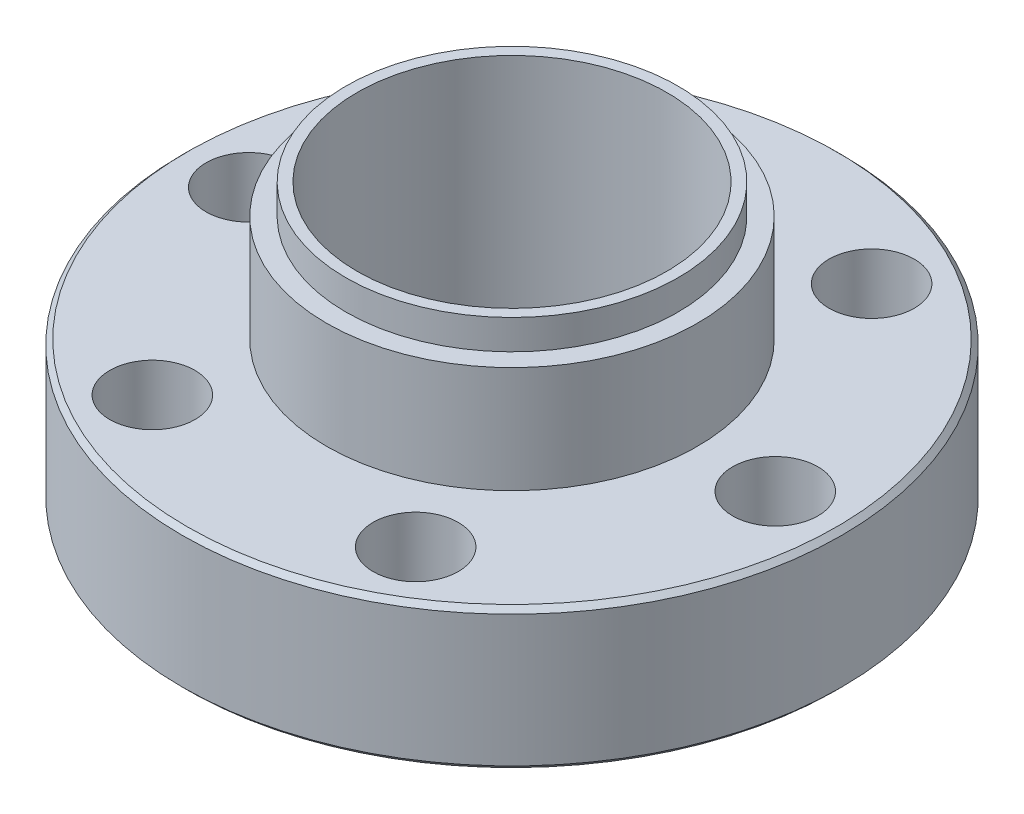
ISO-10303-21;
HEADER;
FILE_DESCRIPTION(('STEP AP214'),'2;1');
FILE_NAME('part.step','',(''),(''),'','','');
FILE_SCHEMA(('AUTOMOTIVE_DESIGN { 1 0 10303 214 1 1 1 1 }'));
ENDSEC;
DATA;
#1=APPLICATION_CONTEXT('core data for automotive mechanical design processes');
#2=APPLICATION_PROTOCOL_DEFINITION('international standard','automotive_design',2000,#1);
#3=PRODUCT_CONTEXT('',#1,'mechanical');
#4=PRODUCT('Part','Part','',(#3));
#5=PRODUCT_RELATED_PRODUCT_CATEGORY('part','',(#4));
#6=PRODUCT_DEFINITION_FORMATION('','',#4);
#7=PRODUCT_DEFINITION_CONTEXT('part definition',#1,'design');
#8=PRODUCT_DEFINITION('design','',#6,#7);
#9=PRODUCT_DEFINITION_SHAPE('','',#8);
#10=(LENGTH_UNIT() NAMED_UNIT(*) SI_UNIT(.MILLI.,.METRE.));
#11=(NAMED_UNIT(*) PLANE_ANGLE_UNIT() SI_UNIT($,.RADIAN.));
#12=(NAMED_UNIT(*) SI_UNIT($,.STERADIAN.) SOLID_ANGLE_UNIT());
#13=UNCERTAINTY_MEASURE_WITH_UNIT(LENGTH_MEASURE(1.E-05),#10,'distance_accuracy_value','');
#14=(GEOMETRIC_REPRESENTATION_CONTEXT(3) GLOBAL_UNCERTAINTY_ASSIGNED_CONTEXT((#13)) GLOBAL_UNIT_ASSIGNED_CONTEXT((#10,
#11,#12)) REPRESENTATION_CONTEXT('',''));
#15=CARTESIAN_POINT('',(0.,0.,0.));
#16=DIRECTION('',(0.,0.,1.));
#17=DIRECTION('',(1.,0.,0.));
#18=AXIS2_PLACEMENT_3D('',#15,#16,#17);
#19=CARTESIAN_POINT('',(0.,12.7,0.));
#20=DIRECTION('',(0.,1.,0.));
#21=DIRECTION('',(0.,0.,1.));
#22=AXIS2_PLACEMENT_3D('',#19,#20,#21);
#23=PLANE('',#22);
#24=CARTESIAN_POINT('',(0.,12.7,0.));
#25=DIRECTION('',(0.,1.,0.));
#26=DIRECTION('',(0.,0.,1.));
#27=AXIS2_PLACEMENT_3D('',#24,#25,#26);
#28=CIRCLE('',#27,9.4996);
#29=CARTESIAN_POINT('',(0.,12.7,9.4996));
#30=VERTEX_POINT('',#29);
#31=EDGE_CURVE('E64',#30,#30,#28,.T.);
#32=ORIENTED_EDGE('',*,*,#31,.T.);
#33=EDGE_LOOP('',(#32));
#34=FACE_BOUND('',#33,.T.);
#35=CARTESIAN_POINT('',(0.,12.7,0.));
#36=DIRECTION('',(0.,1.,0.));
#37=DIRECTION('',(0.,0.,1.));
#38=AXIS2_PLACEMENT_3D('',#35,#36,#37);
#39=CIRCLE('',#38,8.509);
#40=CARTESIAN_POINT('',(0.,12.7,8.509));
#41=VERTEX_POINT('',#40);
#42=EDGE_CURVE('E71',#41,#41,#39,.T.);
#43=ORIENTED_EDGE('',*,*,#42,.F.);
#44=EDGE_LOOP('',(#43));
#45=FACE_BOUND('',#44,.T.);
#46=ADVANCED_FACE('F32',(#34,#45),#23,.T.);
#47=CARTESIAN_POINT('',(0.,7.239,0.));
#48=DIRECTION('',(0.,1.,0.));
#49=DIRECTION('',(0.,0.,1.));
#50=AXIS2_PLACEMENT_3D('',#47,#48,#49);
#51=PLANE('',#50);
#52=CARTESIAN_POINT('',(13.4874,7.239,0.));
#53=DIRECTION('',(0.,1.,0.));
#54=DIRECTION('',(0.,0.,1.));
#55=AXIS2_PLACEMENT_3D('',#52,#53,#54);
#56=CIRCLE('',#55,2.18439999999999);
#57=CARTESIAN_POINT('',(13.4874,7.239,2.18439999999999));
#58=VERTEX_POINT('',#57);
#59=EDGE_CURVE('E112',#58,#58,#56,.T.);
#60=ORIENTED_EDGE('',*,*,#59,.F.);
#61=EDGE_LOOP('',(#60));
#62=FACE_BOUND('',#61,.T.);
#63=CARTESIAN_POINT('',(6.74369999999997,7.239,11.6804310310023));
#64=DIRECTION('',(0.,1.,0.));
#65=DIRECTION('',(0.,0.,1.));
#66=AXIS2_PLACEMENT_3D('',#63,#64,#65);
#67=CIRCLE('',#66,2.18439999999999);
#68=CARTESIAN_POINT('',(6.74369999999997,7.239,13.8648310310022));
#69=VERTEX_POINT('',#68);
#70=EDGE_CURVE('E106',#69,#69,#67,.T.);
#71=ORIENTED_EDGE('',*,*,#70,.F.);
#72=EDGE_LOOP('',(#71));
#73=FACE_BOUND('',#72,.T.);
#74=CARTESIAN_POINT('',(-6.74370000000005,7.239,11.6804310310022));
#75=DIRECTION('',(0.,1.,0.));
#76=DIRECTION('',(0.,0.,1.));
#77=AXIS2_PLACEMENT_3D('',#74,#75,#76);
#78=CIRCLE('',#77,2.18439999999999);
#79=CARTESIAN_POINT('',(-6.74370000000005,7.239,13.8648310310022));
#80=VERTEX_POINT('',#79);
#81=EDGE_CURVE('E100',#80,#80,#78,.T.);
#82=ORIENTED_EDGE('',*,*,#81,.F.);
#83=EDGE_LOOP('',(#82));
#84=FACE_BOUND('',#83,.T.);
#85=CARTESIAN_POINT('',(-13.4874,7.239,0.));
#86=DIRECTION('',(0.,1.,0.));
#87=DIRECTION('',(0.,0.,1.));
#88=AXIS2_PLACEMENT_3D('',#85,#86,#87);
#89=CIRCLE('',#88,2.18439999999999);
#90=CARTESIAN_POINT('',(-13.4874,7.239,2.18439999999989));
#91=VERTEX_POINT('',#90);
#92=EDGE_CURVE('E94',#91,#91,#89,.T.);
#93=ORIENTED_EDGE('',*,*,#92,.F.);
#94=EDGE_LOOP('',(#93));
#95=FACE_BOUND('',#94,.T.);
#96=CARTESIAN_POINT('',(-6.74369999999989,7.239,-11.6804310310023));
#97=DIRECTION('',(0.,1.,0.));
#98=DIRECTION('',(0.,0.,1.));
#99=AXIS2_PLACEMENT_3D('',#96,#97,#98);
#100=CIRCLE('',#99,2.18439999999999);
#101=CARTESIAN_POINT('',(-6.74369999999989,7.239,-9.49603103100231));
#102=VERTEX_POINT('',#101);
#103=EDGE_CURVE('E88',#102,#102,#100,.T.);
#104=ORIENTED_EDGE('',*,*,#103,.F.);
#105=EDGE_LOOP('',(#104));
#106=FACE_BOUND('',#105,.T.);
#107=CARTESIAN_POINT('',(6.74370000000014,7.239,-11.6804310310022));
#108=DIRECTION('',(0.,1.,0.));
#109=DIRECTION('',(0.,0.,1.));
#110=AXIS2_PLACEMENT_3D('',#107,#108,#109);
#111=CIRCLE('',#110,2.18439999999999);
#112=CARTESIAN_POINT('',(6.74370000000014,7.239,-9.49603103100217));
#113=VERTEX_POINT('',#112);
#114=EDGE_CURVE('E82',#113,#113,#111,.T.);
#115=ORIENTED_EDGE('',*,*,#114,.F.);
#116=EDGE_LOOP('',(#115));
#117=FACE_BOUND('',#116,.T.);
#118=CARTESIAN_POINT('',(0.,7.239,0.));
#119=DIRECTION('',(0.,1.,0.));
#120=DIRECTION('',(0.,0.,1.));
#121=AXIS2_PLACEMENT_3D('',#118,#119,#120);
#122=CIRCLE('',#121,16.637);
#123=CARTESIAN_POINT('',(0.,7.239,16.637));
#124=VERTEX_POINT('',#123);
#125=EDGE_CURVE('E58',#124,#124,#122,.T.);
#126=ORIENTED_EDGE('',*,*,#125,.T.);
#127=EDGE_LOOP('',(#126));
#128=FACE_BOUND('',#127,.T.);
#129=CARTESIAN_POINT('',(0.,7.239,0.));
#130=DIRECTION('',(0.,1.,0.));
#131=DIRECTION('',(0.,0.,1.));
#132=AXIS2_PLACEMENT_3D('',#129,#130,#131);
#133=CIRCLE('',#132,9.4996);
#134=CARTESIAN_POINT('',(0.,7.239,9.4996));
#135=VERTEX_POINT('',#134);
#136=EDGE_CURVE('E65',#135,#135,#133,.T.);
#137=ORIENTED_EDGE('',*,*,#136,.F.);
#138=EDGE_LOOP('',(#137));
#139=FACE_BOUND('',#138,.T.);
#140=ADVANCED_FACE('F150',(#62,#73,#84,#95,#106,#117,#128,#139),#51,.T.);
#141=CARTESIAN_POINT('',(0.,0.,0.));
#142=DIRECTION('',(0.,1.,0.));
#143=DIRECTION('',(0.,0.,1.));
#144=AXIS2_PLACEMENT_3D('',#141,#142,#143);
#145=CYLINDRICAL_SURFACE('',#144,9.144);
#146=CARTESIAN_POINT('',(0.,1.29540000000001,0.));
#147=DIRECTION('',(0.,1.,0.));
#148=DIRECTION('',(0.,0.,1.));
#149=AXIS2_PLACEMENT_3D('',#146,#147,#148);
#150=CIRCLE('',#149,9.144);
#151=CARTESIAN_POINT('',(0.,1.29540000000001,9.144));
#152=VERTEX_POINT('',#151);
#153=EDGE_CURVE('E61',#152,#152,#150,.T.);
#154=ORIENTED_EDGE('',*,*,#153,.T.);
#155=EDGE_LOOP('',(#154));
#156=FACE_BOUND('',#155,.T.);
#157=CARTESIAN_POINT('',(0.,0.6604,0.));
#158=DIRECTION('',(0.,1.,0.));
#159=DIRECTION('',(0.,0.,1.));
#160=AXIS2_PLACEMENT_3D('',#157,#158,#159);
#161=CIRCLE('',#160,9.144);
#162=CARTESIAN_POINT('',(0.,0.6604,9.144));
#163=VERTEX_POINT('',#162);
#164=EDGE_CURVE('E43',#163,#163,#161,.T.);
#165=ORIENTED_EDGE('',*,*,#164,.F.);
#166=EDGE_LOOP('',(#165));
#167=FACE_BOUND('',#166,.T.);
#168=ADVANCED_FACE('F146',(#156,#167),#145,.F.);
#169=CARTESIAN_POINT('',(0.,1.23358032492243,0.));
#170=DIRECTION('',(0.,1.,0.));
#171=DIRECTION('',(0.,0.,1.));
#172=AXIS2_PLACEMENT_3D('',#169,#170,#171);
#173=CONICAL_SURFACE('',#172,10.7188,1.22173047639602);
#174=ORIENTED_EDGE('',*,*,#164,.T.);
#175=EDGE_LOOP('',(#174));
#176=FACE_BOUND('',#175,.T.);
#177=CARTESIAN_POINT('',(0.,1.23358032492243,0.));
#178=DIRECTION('',(0.,1.,0.));
#179=DIRECTION('',(0.,0.,1.));
#180=AXIS2_PLACEMENT_3D('',#177,#178,#179);
#181=CIRCLE('',#180,10.7188);
#182=CARTESIAN_POINT('',(0.,1.23358032492243,10.7188));
#183=VERTEX_POINT('',#182);
#184=EDGE_CURVE('E47',#183,#183,#181,.T.);
#185=ORIENTED_EDGE('',*,*,#184,.F.);
#186=EDGE_LOOP('',(#185));
#187=FACE_BOUND('',#186,.T.);
#188=ADVANCED_FACE('F140',(#176,#187),#173,.T.);
#189=CARTESIAN_POINT('',(0.,0.,0.));
#190=DIRECTION('',(0.,1.,0.));
#191=DIRECTION('',(0.,0.,1.));
#192=AXIS2_PLACEMENT_3D('',#189,#190,#191);
#193=CYLINDRICAL_SURFACE('',#192,10.7188);
#194=ORIENTED_EDGE('',*,*,#184,.T.);
#195=EDGE_LOOP('',(#194));
#196=FACE_BOUND('',#195,.T.);
#197=CARTESIAN_POINT('',(0.,0.,0.));
#198=DIRECTION('',(0.,1.,0.));
#199=DIRECTION('',(0.,0.,1.));
#200=AXIS2_PLACEMENT_3D('',#197,#198,#199);
#201=CIRCLE('',#200,10.7188);
#202=CARTESIAN_POINT('',(0.,0.,10.7188));
#203=VERTEX_POINT('',#202);
#204=EDGE_CURVE('E52',#203,#203,#201,.T.);
#205=ORIENTED_EDGE('',*,*,#204,.F.);
#206=EDGE_LOOP('',(#205));
#207=FACE_BOUND('',#206,.T.);
#208=ADVANCED_FACE('F125',(#196,#207),#193,.F.);
#209=CARTESIAN_POINT('',(16.891,0.,0.));
#210=DIRECTION('',(0.,-1.,0.));
#211=DIRECTION('',(0.,0.,-1.));
#212=AXIS2_PLACEMENT_3D('',#209,#210,#211);
#213=PLANE('',#212);
#214=CARTESIAN_POINT('',(0.,0.,0.));
#215=DIRECTION('',(0.,-1.,0.));
#216=DIRECTION('',(0.,0.,-1.));
#217=AXIS2_PLACEMENT_3D('',#214,#215,#216);
#218=CIRCLE('',#217,16.637);
#219=CARTESIAN_POINT('',(0.,0.,-16.637));
#220=VERTEX_POINT('',#219);
#221=EDGE_CURVE('E10',#220,#220,#218,.T.);
#222=ORIENTED_EDGE('',*,*,#221,.T.);
#223=EDGE_LOOP('',(#222));
#224=FACE_BOUND('',#223,.T.);
#225=CARTESIAN_POINT('',(13.4874,0.,0.));
#226=DIRECTION('',(0.,-1.,0.));
#227=DIRECTION('',(0.,0.,-1.));
#228=AXIS2_PLACEMENT_3D('',#225,#226,#227);
#229=CIRCLE('',#228,2.18439999999999);
#230=CARTESIAN_POINT('',(13.4874,0.,-2.18439999999999));
#231=VERTEX_POINT('',#230);
#232=EDGE_CURVE('E115',#231,#231,#229,.T.);
#233=ORIENTED_EDGE('',*,*,#232,.F.);
#234=EDGE_LOOP('',(#233));
#235=FACE_BOUND('',#234,.T.);
#236=CARTESIAN_POINT('',(6.74369999999997,0.,11.6804310310023));
#237=DIRECTION('',(0.,-1.,0.));
#238=DIRECTION('',(0.,0.,-1.));
#239=AXIS2_PLACEMENT_3D('',#236,#237,#238);
#240=CIRCLE('',#239,2.18439999999999);
#241=CARTESIAN_POINT('',(6.74369999999997,0.,9.49603103100227));
#242=VERTEX_POINT('',#241);
#243=EDGE_CURVE('E109',#242,#242,#240,.T.);
#244=ORIENTED_EDGE('',*,*,#243,.F.);
#245=EDGE_LOOP('',(#244));
#246=FACE_BOUND('',#245,.T.);
#247=CARTESIAN_POINT('',(-6.74370000000005,0.,11.6804310310022));
#248=DIRECTION('',(0.,-1.,0.));
#249=DIRECTION('',(0.,0.,-1.));
#250=AXIS2_PLACEMENT_3D('',#247,#248,#249);
#251=CIRCLE('',#250,2.18439999999999);
#252=CARTESIAN_POINT('',(-6.74370000000005,0.,9.49603103100222));
#253=VERTEX_POINT('',#252);
#254=EDGE_CURVE('E103',#253,#253,#251,.T.);
#255=ORIENTED_EDGE('',*,*,#254,.F.);
#256=EDGE_LOOP('',(#255));
#257=FACE_BOUND('',#256,.T.);
#258=CARTESIAN_POINT('',(-13.4874,0.,0.));
#259=DIRECTION('',(0.,-1.,0.));
#260=DIRECTION('',(0.,0.,-1.));
#261=AXIS2_PLACEMENT_3D('',#258,#259,#260);
#262=CIRCLE('',#261,2.18439999999999);
#263=CARTESIAN_POINT('',(-13.4874,0.,-2.18440000000008));
#264=VERTEX_POINT('',#263);
#265=EDGE_CURVE('E97',#264,#264,#262,.T.);
#266=ORIENTED_EDGE('',*,*,#265,.F.);
#267=EDGE_LOOP('',(#266));
#268=FACE_BOUND('',#267,.T.);
#269=CARTESIAN_POINT('',(-6.74369999999989,0.,-11.6804310310023));
#270=DIRECTION('',(0.,-1.,0.));
#271=DIRECTION('',(0.,0.,-1.));
#272=AXIS2_PLACEMENT_3D('',#269,#270,#271);
#273=CIRCLE('',#272,2.18439999999999);
#274=CARTESIAN_POINT('',(-6.74369999999989,0.,-13.8648310310023));
#275=VERTEX_POINT('',#274);
#276=EDGE_CURVE('E91',#275,#275,#273,.T.);
#277=ORIENTED_EDGE('',*,*,#276,.F.);
#278=EDGE_LOOP('',(#277));
#279=FACE_BOUND('',#278,.T.);
#280=CARTESIAN_POINT('',(6.74370000000014,0.,-11.6804310310022));
#281=DIRECTION('',(0.,-1.,0.));
#282=DIRECTION('',(0.,0.,-1.));
#283=AXIS2_PLACEMENT_3D('',#280,#281,#282);
#284=CIRCLE('',#283,2.18439999999999);
#285=CARTESIAN_POINT('',(6.74370000000014,0.,-13.8648310310021));
#286=VERTEX_POINT('',#285);
#287=EDGE_CURVE('E85',#286,#286,#284,.T.);
#288=ORIENTED_EDGE('',*,*,#287,.F.);
#289=EDGE_LOOP('',(#288));
#290=FACE_BOUND('',#289,.T.);
#291=ORIENTED_EDGE('',*,*,#204,.T.);
#292=EDGE_LOOP('',(#291));
#293=FACE_BOUND('',#292,.T.);
#294=ADVANCED_FACE('F121',(#224,#235,#246,#257,#268,#279,#290,#293),#213,.T.);
#295=CARTESIAN_POINT('',(0.,0.,0.));
#296=DIRECTION('',(0.,1.,0.));
#297=DIRECTION('',(0.,0.,1.));
#298=AXIS2_PLACEMENT_3D('',#295,#296,#297);
#299=CYLINDRICAL_SURFACE('',#298,16.891);
#300=CARTESIAN_POINT('',(0.,0.253999999999997,0.));
#301=DIRECTION('',(0.,-1.,0.));
#302=DIRECTION('',(0.,0.,-1.));
#303=AXIS2_PLACEMENT_3D('',#300,#301,#302);
#304=CIRCLE('',#303,16.891);
#305=CARTESIAN_POINT('',(0.,0.253999999999997,-16.891));
#306=VERTEX_POINT('',#305);
#307=EDGE_CURVE('E39',#306,#306,#304,.F.);
#308=ORIENTED_EDGE('',*,*,#307,.T.);
#309=EDGE_LOOP('',(#308));
#310=FACE_BOUND('',#309,.T.);
#311=CARTESIAN_POINT('',(0.,6.985,0.));
#312=DIRECTION('',(0.,1.,0.));
#313=DIRECTION('',(0.,0.,1.));
#314=AXIS2_PLACEMENT_3D('',#311,#312,#313);
#315=CIRCLE('',#314,16.891);
#316=CARTESIAN_POINT('',(0.,6.985,16.891));
#317=VERTEX_POINT('',#316);
#318=EDGE_CURVE('E55',#317,#317,#315,.T.);
#319=ORIENTED_EDGE('',*,*,#318,.F.);
#320=EDGE_LOOP('',(#319));
#321=FACE_BOUND('',#320,.T.);
#322=ADVANCED_FACE('F124',(#310,#321),#299,.T.);
#323=CARTESIAN_POINT('',(0.,7.239,0.));
#324=DIRECTION('',(0.,-1.,0.));
#325=DIRECTION('',(0.,0.,-1.));
#326=AXIS2_PLACEMENT_3D('',#323,#324,#325);
#327=CONICAL_SURFACE('',#326,16.637,0.785398163397455);
#328=ORIENTED_EDGE('',*,*,#318,.T.);
#329=EDGE_LOOP('',(#328));
#330=FACE_BOUND('',#329,.T.);
#331=ORIENTED_EDGE('',*,*,#125,.F.);
#332=EDGE_LOOP('',(#331));
#333=FACE_BOUND('',#332,.T.);
#334=ADVANCED_FACE('F169',(#330,#333),#327,.T.);
#335=CARTESIAN_POINT('',(9.144,1.29540000000001,0.));
#336=DIRECTION('',(0.,-1.,0.));
#337=DIRECTION('',(0.,0.,-1.));
#338=AXIS2_PLACEMENT_3D('',#335,#336,#337);
#339=PLANE('',#338);
#340=CARTESIAN_POINT('',(0.,1.29539999999997,0.));
#341=DIRECTION('',(0.,1.,0.));
#342=DIRECTION('',(0.,0.,1.));
#343=AXIS2_PLACEMENT_3D('',#340,#341,#342);
#344=CIRCLE('',#343,7.93749999999999);
#345=CARTESIAN_POINT('',(0.,1.29539999999997,7.93749999999999));
#346=VERTEX_POINT('',#345);
#347=EDGE_CURVE('E74',#346,#346,#344,.T.);
#348=ORIENTED_EDGE('',*,*,#347,.T.);
#349=EDGE_LOOP('',(#348));
#350=FACE_BOUND('',#349,.T.);
#351=ORIENTED_EDGE('',*,*,#153,.F.);
#352=EDGE_LOOP('',(#351));
#353=FACE_BOUND('',#352,.T.);
#354=ADVANCED_FACE('F166',(#350,#353),#339,.T.);
#355=CARTESIAN_POINT('',(0.,12.7,0.));
#356=DIRECTION('',(0.,-1.,0.));
#357=DIRECTION('',(0.,0.,-1.));
#358=AXIS2_PLACEMENT_3D('',#355,#356,#357);
#359=CYLINDRICAL_SURFACE('',#358,9.4996);
#360=ORIENTED_EDGE('',*,*,#31,.F.);
#361=EDGE_LOOP('',(#360));
#362=FACE_BOUND('',#361,.T.);
#363=ORIENTED_EDGE('',*,*,#136,.T.);
#364=EDGE_LOOP('',(#363));
#365=FACE_BOUND('',#364,.T.);
#366=ADVANCED_FACE('F163',(#362,#365),#359,.T.);
#367=CARTESIAN_POINT('',(0.,14.224,0.));
#368=DIRECTION('',(0.,-1.,0.));
#369=DIRECTION('',(0.,0.,-1.));
#370=AXIS2_PLACEMENT_3D('',#367,#368,#369);
#371=CYLINDRICAL_SURFACE('',#370,8.509);
#372=CARTESIAN_POINT('',(0.,14.224,0.));
#373=DIRECTION('',(0.,1.,0.));
#374=DIRECTION('',(0.,0.,1.));
#375=AXIS2_PLACEMENT_3D('',#372,#373,#374);
#376=CIRCLE('',#375,8.509);
#377=CARTESIAN_POINT('',(0.,14.224,8.509));
#378=VERTEX_POINT('',#377);
#379=EDGE_CURVE('E68',#378,#378,#376,.T.);
#380=ORIENTED_EDGE('',*,*,#379,.F.);
#381=EDGE_LOOP('',(#380));
#382=FACE_BOUND('',#381,.T.);
#383=ORIENTED_EDGE('',*,*,#42,.T.);
#384=EDGE_LOOP('',(#383));
#385=FACE_BOUND('',#384,.T.);
#386=ADVANCED_FACE('F161',(#382,#385),#371,.T.);
#387=CARTESIAN_POINT('',(0.,14.224,0.));
#388=DIRECTION('',(0.,1.,0.));
#389=DIRECTION('',(0.,0.,1.));
#390=AXIS2_PLACEMENT_3D('',#387,#388,#389);
#391=PLANE('',#390);
#392=CARTESIAN_POINT('',(0.,14.224,0.));
#393=DIRECTION('',(0.,1.,0.));
#394=DIRECTION('',(0.,0.,1.));
#395=AXIS2_PLACEMENT_3D('',#392,#393,#394);
#396=CIRCLE('',#395,7.93749999999999);
#397=CARTESIAN_POINT('',(0.,14.224,7.93749999999999));
#398=VERTEX_POINT('',#397);
#399=EDGE_CURVE('E79',#398,#398,#396,.T.);
#400=ORIENTED_EDGE('',*,*,#399,.F.);
#401=EDGE_LOOP('',(#400));
#402=FACE_BOUND('',#401,.T.);
#403=ORIENTED_EDGE('',*,*,#379,.T.);
#404=EDGE_LOOP('',(#403));
#405=FACE_BOUND('',#404,.T.);
#406=ADVANCED_FACE('F208',(#402,#405),#391,.T.);
#407=CARTESIAN_POINT('',(0.,14.224,0.));
#408=DIRECTION('',(0.,1.,0.));
#409=DIRECTION('',(0.,0.,1.));
#410=AXIS2_PLACEMENT_3D('',#407,#408,#409);
#411=CYLINDRICAL_SURFACE('',#410,7.93749999999999);
#412=ORIENTED_EDGE('',*,*,#347,.F.);
#413=EDGE_LOOP('',(#412));
#414=FACE_BOUND('',#413,.T.);
#415=ORIENTED_EDGE('',*,*,#399,.T.);
#416=EDGE_LOOP('',(#415));
#417=FACE_BOUND('',#416,.T.);
#418=ADVANCED_FACE('F214',(#414,#417),#411,.F.);
#419=CARTESIAN_POINT('',(6.74370000000014,0.,-11.6804310310022));
#420=DIRECTION('',(0.,-1.,0.));
#421=DIRECTION('',(0.,0.,-1.));
#422=AXIS2_PLACEMENT_3D('',#419,#420,#421);
#423=CYLINDRICAL_SURFACE('',#422,2.18439999999999);
#424=ORIENTED_EDGE('',*,*,#114,.T.);
#425=EDGE_LOOP('',(#424));
#426=FACE_BOUND('',#425,.T.);
#427=ORIENTED_EDGE('',*,*,#287,.T.);
#428=EDGE_LOOP('',(#427));
#429=FACE_BOUND('',#428,.T.);
#430=ADVANCED_FACE('F221',(#426,#429),#423,.F.);
#431=CARTESIAN_POINT('',(-6.74369999999989,0.,-11.6804310310023));
#432=DIRECTION('',(0.,-1.,0.));
#433=DIRECTION('',(0.,0.,-1.));
#434=AXIS2_PLACEMENT_3D('',#431,#432,#433);
#435=CYLINDRICAL_SURFACE('',#434,2.18439999999999);
#436=ORIENTED_EDGE('',*,*,#103,.T.);
#437=EDGE_LOOP('',(#436));
#438=FACE_BOUND('',#437,.T.);
#439=ORIENTED_EDGE('',*,*,#276,.T.);
#440=EDGE_LOOP('',(#439));
#441=FACE_BOUND('',#440,.T.);
#442=ADVANCED_FACE('F230',(#438,#441),#435,.F.);
#443=CARTESIAN_POINT('',(-13.4874,0.,0.));
#444=DIRECTION('',(0.,-1.,0.));
#445=DIRECTION('',(0.,0.,-1.));
#446=AXIS2_PLACEMENT_3D('',#443,#444,#445);
#447=CYLINDRICAL_SURFACE('',#446,2.18439999999999);
#448=ORIENTED_EDGE('',*,*,#92,.T.);
#449=EDGE_LOOP('',(#448));
#450=FACE_BOUND('',#449,.T.);
#451=ORIENTED_EDGE('',*,*,#265,.T.);
#452=EDGE_LOOP('',(#451));
#453=FACE_BOUND('',#452,.T.);
#454=ADVANCED_FACE('F238',(#450,#453),#447,.F.);
#455=CARTESIAN_POINT('',(-6.74370000000005,0.,11.6804310310022));
#456=DIRECTION('',(0.,-1.,0.));
#457=DIRECTION('',(0.,0.,-1.));
#458=AXIS2_PLACEMENT_3D('',#455,#456,#457);
#459=CYLINDRICAL_SURFACE('',#458,2.18439999999999);
#460=ORIENTED_EDGE('',*,*,#81,.T.);
#461=EDGE_LOOP('',(#460));
#462=FACE_BOUND('',#461,.T.);
#463=ORIENTED_EDGE('',*,*,#254,.T.);
#464=EDGE_LOOP('',(#463));
#465=FACE_BOUND('',#464,.T.);
#466=ADVANCED_FACE('F246',(#462,#465),#459,.F.);
#467=CARTESIAN_POINT('',(6.74369999999997,0.,11.6804310310023));
#468=DIRECTION('',(0.,-1.,0.));
#469=DIRECTION('',(0.,0.,-1.));
#470=AXIS2_PLACEMENT_3D('',#467,#468,#469);
#471=CYLINDRICAL_SURFACE('',#470,2.18439999999999);
#472=ORIENTED_EDGE('',*,*,#70,.T.);
#473=EDGE_LOOP('',(#472));
#474=FACE_BOUND('',#473,.T.);
#475=ORIENTED_EDGE('',*,*,#243,.T.);
#476=EDGE_LOOP('',(#475));
#477=FACE_BOUND('',#476,.T.);
#478=ADVANCED_FACE('F254',(#474,#477),#471,.F.);
#479=CARTESIAN_POINT('',(13.4874,0.,0.));
#480=DIRECTION('',(0.,-1.,0.));
#481=DIRECTION('',(0.,0.,-1.));
#482=AXIS2_PLACEMENT_3D('',#479,#480,#481);
#483=CYLINDRICAL_SURFACE('',#482,2.18439999999999);
#484=ORIENTED_EDGE('',*,*,#59,.T.);
#485=EDGE_LOOP('',(#484));
#486=FACE_BOUND('',#485,.T.);
#487=ORIENTED_EDGE('',*,*,#232,.T.);
#488=EDGE_LOOP('',(#487));
#489=FACE_BOUND('',#488,.T.);
#490=ADVANCED_FACE('F119',(#486,#489),#483,.F.);
#491=CARTESIAN_POINT('',(0.,0.253999999999997,0.));
#492=DIRECTION('',(0.,1.,0.));
#493=DIRECTION('',(0.,0.,1.));
#494=AXIS2_PLACEMENT_3D('',#491,#492,#493);
#495=CONICAL_SURFACE('',#494,16.891,0.785398163397455);
#496=ORIENTED_EDGE('',*,*,#221,.F.);
#497=EDGE_LOOP('',(#496));
#498=FACE_BOUND('',#497,.T.);
#499=ORIENTED_EDGE('',*,*,#307,.F.);
#500=EDGE_LOOP('',(#499));
#501=FACE_BOUND('',#500,.T.);
#502=ADVANCED_FACE('F34',(#498,#501),#495,.T.);
#503=CLOSED_SHELL('',(#46,#140,#168,#188,#208,#294,#322,#334,#354,#366,#386,#406,#418,#430,#442,
#454,#466,#478,#490,#502));
#504=MANIFOLD_SOLID_BREP('B2',#503);
#505=ADVANCED_BREP_SHAPE_REPRESENTATION('',(#18,#504),#14);
#506=SHAPE_DEFINITION_REPRESENTATION(#9,#505);
ENDSEC;
END-ISO-10303-21;
